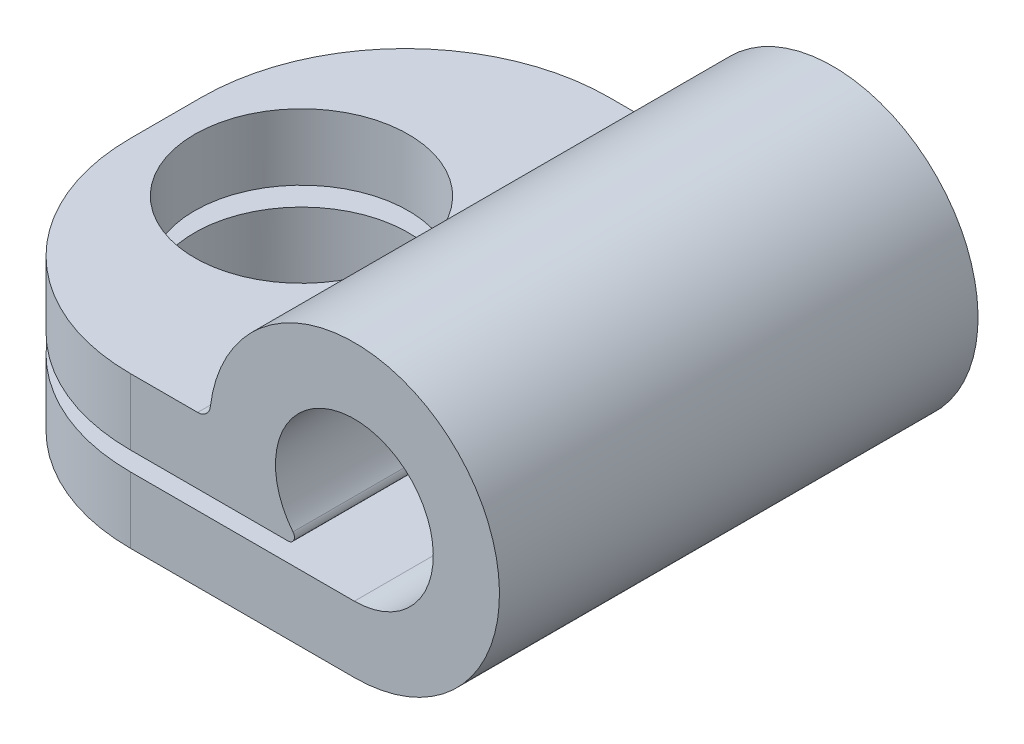
ISO-10303-21;
HEADER;
FILE_DESCRIPTION(('STEP AP214'),'2;1');
FILE_NAME('part.step','',(''),(''),'','','');
FILE_SCHEMA(('AUTOMOTIVE_DESIGN { 1 0 10303 214 1 1 1 1 }'));
ENDSEC;
DATA;
#1=APPLICATION_CONTEXT('core data for automotive mechanical design processes');
#2=APPLICATION_PROTOCOL_DEFINITION('international standard','automotive_design',2000,#1);
#3=PRODUCT_CONTEXT('',#1,'mechanical');
#4=PRODUCT('Part','Part','',(#3));
#5=PRODUCT_RELATED_PRODUCT_CATEGORY('part','',(#4));
#6=PRODUCT_DEFINITION_FORMATION('','',#4);
#7=PRODUCT_DEFINITION_CONTEXT('part definition',#1,'design');
#8=PRODUCT_DEFINITION('design','',#6,#7);
#9=PRODUCT_DEFINITION_SHAPE('','',#8);
#10=(LENGTH_UNIT() NAMED_UNIT(*) SI_UNIT(.MILLI.,.METRE.));
#11=(NAMED_UNIT(*) PLANE_ANGLE_UNIT() SI_UNIT($,.RADIAN.));
#12=(NAMED_UNIT(*) SI_UNIT($,.STERADIAN.) SOLID_ANGLE_UNIT());
#13=UNCERTAINTY_MEASURE_WITH_UNIT(LENGTH_MEASURE(1.E-05),#10,'distance_accuracy_value','');
#14=(GEOMETRIC_REPRESENTATION_CONTEXT(3) GLOBAL_UNCERTAINTY_ASSIGNED_CONTEXT((#13)) GLOBAL_UNIT_ASSIGNED_CONTEXT((#10,
#11,#12)) REPRESENTATION_CONTEXT('',''));
#15=CARTESIAN_POINT('',(0.,0.,0.));
#16=DIRECTION('',(0.,0.,1.));
#17=DIRECTION('',(1.,0.,0.));
#18=AXIS2_PLACEMENT_3D('',#15,#16,#17);
#19=CARTESIAN_POINT('',(-1.3027933545361,-1.05278415421993,9.4));
#20=DIRECTION('',(0.,0.,-1.));
#21=DIRECTION('',(-1.,0.,0.));
#22=AXIS2_PLACEMENT_3D('',#19,#20,#21);
#23=CYLINDRICAL_SURFACE('',#22,0.125);
#24=CARTESIAN_POINT('',(-1.3027933545361,-1.05278415421993,0.));
#25=DIRECTION('',(0.,0.,1.));
#26=DIRECTION('',(1.,0.,0.));
#27=AXIS2_PLACEMENT_3D('',#24,#25,#26);
#28=CIRCLE('',#27,0.125);
#29=CARTESIAN_POINT('',(-1.3027933545361,-1.17778415421993,0.));
#30=VERTEX_POINT('',#29);
#31=CARTESIAN_POINT('',(-1.20556996986923,-0.974218172561726,0.));
#32=VERTEX_POINT('',#31);
#33=EDGE_CURVE('E161',#30,#32,#28,.T.);
#34=ORIENTED_EDGE('',*,*,#33,.T.);
#35=DIRECTION('',(0.,0.,-1.));
#36=VECTOR('',#35,1.);
#37=CARTESIAN_POINT('',(-1.20556996986923,-0.974218172561726,9.4));
#38=LINE('',#37,#36);
#39=CARTESIAN_POINT('',(-1.20556996986923,-0.974218172561726,9.4));
#40=VERTEX_POINT('',#39);
#41=EDGE_CURVE('E140',#40,#32,#38,.T.);
#42=ORIENTED_EDGE('',*,*,#41,.F.);
#43=CARTESIAN_POINT('',(-1.3027933545361,-1.05278415421993,9.4));
#44=DIRECTION('',(0.,0.,1.));
#45=DIRECTION('',(1.,0.,0.));
#46=AXIS2_PLACEMENT_3D('',#43,#44,#45);
#47=CIRCLE('',#46,0.125);
#48=CARTESIAN_POINT('',(-1.3027933545361,-1.17778415421993,9.4));
#49=VERTEX_POINT('',#48);
#50=EDGE_CURVE('E148',#49,#40,#47,.T.);
#51=ORIENTED_EDGE('',*,*,#50,.F.);
#52=DIRECTION('',(0.,0.,-1.));
#53=VECTOR('',#52,1.);
#54=CARTESIAN_POINT('',(-1.3027933545361,-1.17778415421993,9.4));
#55=LINE('',#54,#53);
#56=EDGE_CURVE('E210',#49,#30,#55,.T.);
#57=ORIENTED_EDGE('',*,*,#56,.T.);
#58=EDGE_LOOP('',(#34,#42,#51,#57));
#59=FACE_BOUND('',#58,.T.);
#60=ADVANCED_FACE('F35',(#59),#23,.T.);
#61=CARTESIAN_POINT('',(0.,0.,9.4));
#62=DIRECTION('',(0.,0.,-1.));
#63=DIRECTION('',(-1.,0.,0.));
#64=AXIS2_PLACEMENT_3D('',#61,#62,#63);
#65=CYLINDRICAL_SURFACE('',#64,1.55);
#66=CARTESIAN_POINT('',(0.,0.,0.));
#67=DIRECTION('',(0.,0.,-1.));
#68=DIRECTION('',(1.,0.,0.));
#69=AXIS2_PLACEMENT_3D('',#66,#67,#68);
#70=CIRCLE('',#69,1.55);
#71=CARTESIAN_POINT('',(0.,-1.55,0.));
#72=VERTEX_POINT('',#71);
#73=EDGE_CURVE('E256',#32,#72,#70,.T.);
#74=ORIENTED_EDGE('',*,*,#73,.T.);
#75=DIRECTION('',(0.,0.,-1.));
#76=VECTOR('',#75,1.);
#77=CARTESIAN_POINT('',(0.,-1.55,9.4));
#78=LINE('',#77,#76);
#79=CARTESIAN_POINT('',(0.,-1.55,9.4));
#80=VERTEX_POINT('',#79);
#81=EDGE_CURVE('E143',#80,#72,#78,.T.);
#82=ORIENTED_EDGE('',*,*,#81,.F.);
#83=CARTESIAN_POINT('',(0.,0.,9.4));
#84=DIRECTION('',(0.,0.,-1.));
#85=DIRECTION('',(1.,0.,0.));
#86=AXIS2_PLACEMENT_3D('',#83,#84,#85);
#87=CIRCLE('',#86,1.55);
#88=EDGE_CURVE('E136',#40,#80,#87,.T.);
#89=ORIENTED_EDGE('',*,*,#88,.F.);
#90=ORIENTED_EDGE('',*,*,#41,.T.);
#91=EDGE_LOOP('',(#74,#82,#89,#90));
#92=FACE_BOUND('',#91,.T.);
#93=ADVANCED_FACE('F138',(#92),#65,.F.);
#94=CARTESIAN_POINT('',(0.,-1.55,9.4));
#95=DIRECTION('',(0.,-1.,0.));
#96=DIRECTION('',(1.,0.,0.));
#97=AXIS2_PLACEMENT_3D('',#94,#95,#96);
#98=PLANE('',#97);
#99=CARTESIAN_POINT('',(-5.73878648325151,-1.55,4.7));
#100=DIRECTION('',(0.,-1.,0.));
#101=DIRECTION('',(1.,0.,0.));
#102=AXIS2_PLACEMENT_3D('',#99,#100,#101);
#103=CIRCLE('',#102,2.1);
#104=CARTESIAN_POINT('',(-3.63878648325151,-1.55,4.7));
#105=VERTEX_POINT('',#104);
#106=EDGE_CURVE('E263',#105,#105,#103,.T.);
#107=ORIENTED_EDGE('',*,*,#106,.T.);
#108=EDGE_LOOP('',(#107));
#109=FACE_BOUND('',#108,.T.);
#110=DIRECTION('',(-1.,0.,0.));
#111=VECTOR('',#110,1.);
#112=CARTESIAN_POINT('',(0.,-1.55,0.));
#113=LINE('',#112,#111);
#114=CARTESIAN_POINT('',(-4.4,-1.55,0.));
#115=VERTEX_POINT('',#114);
#116=EDGE_CURVE('E252',#72,#115,#113,.T.);
#117=ORIENTED_EDGE('',*,*,#116,.T.);
#118=CARTESIAN_POINT('',(-4.4,-1.55,4.));
#119=DIRECTION('',(0.,-1.,0.));
#120=DIRECTION('',(1.,0.,0.));
#121=AXIS2_PLACEMENT_3D('',#118,#119,#120);
#122=CIRCLE('',#121,4.);
#123=CARTESIAN_POINT('',(-8.4,-1.55,4.));
#124=VERTEX_POINT('',#123);
#125=EDGE_CURVE('E187',#115,#124,#122,.F.);
#126=ORIENTED_EDGE('',*,*,#125,.T.);
#127=DIRECTION('',(0.,0.,-1.));
#128=VECTOR('',#127,1.);
#129=CARTESIAN_POINT('',(-8.4,-1.55,9.4));
#130=LINE('',#129,#128);
#131=CARTESIAN_POINT('',(-8.4,-1.55,5.4));
#132=VERTEX_POINT('',#131);
#133=EDGE_CURVE('E166',#132,#124,#130,.T.);
#134=ORIENTED_EDGE('',*,*,#133,.F.);
#135=CARTESIAN_POINT('',(-4.4,-1.55,5.4));
#136=DIRECTION('',(0.,-1.,0.));
#137=DIRECTION('',(1.,0.,0.));
#138=AXIS2_PLACEMENT_3D('',#135,#136,#137);
#139=CIRCLE('',#138,4.);
#140=CARTESIAN_POINT('',(-4.4,-1.55,9.4));
#141=VERTEX_POINT('',#140);
#142=EDGE_CURVE('E185',#132,#141,#139,.F.);
#143=ORIENTED_EDGE('',*,*,#142,.T.);
#144=DIRECTION('',(-1.,0.,0.));
#145=VECTOR('',#144,1.);
#146=CARTESIAN_POINT('',(0.,-1.55,9.4));
#147=LINE('',#146,#145);
#148=EDGE_CURVE('E147',#80,#141,#147,.T.);
#149=ORIENTED_EDGE('',*,*,#148,.F.);
#150=ORIENTED_EDGE('',*,*,#81,.T.);
#151=EDGE_LOOP('',(#117,#126,#134,#143,#149,#150));
#152=FACE_BOUND('',#151,.T.);
#153=ADVANCED_FACE('F310',(#109,#152),#98,.F.);
#154=CARTESIAN_POINT('',(-8.4,-2.85,9.4));
#155=DIRECTION('',(1.,0.,0.));
#156=DIRECTION('',(0.,0.,-1.));
#157=AXIS2_PLACEMENT_3D('',#154,#155,#156);
#158=PLANE('',#157);
#159=ORIENTED_EDGE('',*,*,#133,.T.);
#160=DIRECTION('',(0.,-1.,0.));
#161=VECTOR('',#160,1.);
#162=CARTESIAN_POINT('',(-8.4,-2.85,4.));
#163=LINE('',#162,#161);
#164=CARTESIAN_POINT('',(-8.4,-2.85,4.));
#165=VERTEX_POINT('',#164);
#166=EDGE_CURVE('E164',#124,#165,#163,.T.);
#167=ORIENTED_EDGE('',*,*,#166,.T.);
#168=DIRECTION('',(0.,0.,-1.));
#169=VECTOR('',#168,1.);
#170=CARTESIAN_POINT('',(-8.4,-2.85,9.4));
#171=LINE('',#170,#169);
#172=CARTESIAN_POINT('',(-8.4,-2.85,5.4));
#173=VERTEX_POINT('',#172);
#174=EDGE_CURVE('E225',#173,#165,#171,.T.);
#175=ORIENTED_EDGE('',*,*,#174,.F.);
#176=DIRECTION('',(0.,-1.,0.));
#177=VECTOR('',#176,1.);
#178=CARTESIAN_POINT('',(-8.4,-1.55,5.4));
#179=LINE('',#178,#177);
#180=EDGE_CURVE('E162',#173,#132,#179,.F.);
#181=ORIENTED_EDGE('',*,*,#180,.T.);
#182=EDGE_LOOP('',(#159,#167,#175,#181));
#183=FACE_BOUND('',#182,.T.);
#184=ADVANCED_FACE('F231',(#183),#158,.F.);
#185=CARTESIAN_POINT('',(0.,-2.85,9.4));
#186=DIRECTION('',(0.,1.,0.));
#187=DIRECTION('',(0.,0.,1.));
#188=AXIS2_PLACEMENT_3D('',#185,#186,#187);
#189=PLANE('',#188);
#190=CARTESIAN_POINT('',(-5.73878648325151,-2.85,4.7));
#191=DIRECTION('',(0.,1.,0.));
#192=DIRECTION('',(0.,0.,1.));
#193=AXIS2_PLACEMENT_3D('',#190,#191,#192);
#194=CIRCLE('',#193,2.1);
#195=CARTESIAN_POINT('',(-5.73878648325151,-2.85,6.8));
#196=VERTEX_POINT('',#195);
#197=EDGE_CURVE('E172',#196,#196,#194,.T.);
#198=ORIENTED_EDGE('',*,*,#197,.T.);
#199=EDGE_LOOP('',(#198));
#200=FACE_BOUND('',#199,.T.);
#201=ORIENTED_EDGE('',*,*,#174,.T.);
#202=CARTESIAN_POINT('',(-4.4,-2.85,4.));
#203=DIRECTION('',(0.,1.,0.));
#204=DIRECTION('',(0.,0.,1.));
#205=AXIS2_PLACEMENT_3D('',#202,#203,#204);
#206=CIRCLE('',#205,4.);
#207=CARTESIAN_POINT('',(-4.4,-2.85,0.));
#208=VERTEX_POINT('',#207);
#209=EDGE_CURVE('E179',#165,#208,#206,.F.);
#210=ORIENTED_EDGE('',*,*,#209,.T.);
#211=DIRECTION('',(1.,0.,0.));
#212=VECTOR('',#211,1.);
#213=CARTESIAN_POINT('',(0.,-2.85,0.));
#214=LINE('',#213,#212);
#215=CARTESIAN_POINT('',(0.,-2.85,0.));
#216=VERTEX_POINT('',#215);
#217=EDGE_CURVE('E244',#208,#216,#214,.T.);
#218=ORIENTED_EDGE('',*,*,#217,.T.);
#219=DIRECTION('',(0.,0.,-1.));
#220=VECTOR('',#219,1.);
#221=CARTESIAN_POINT('',(0.,-2.85,9.4));
#222=LINE('',#221,#220);
#223=CARTESIAN_POINT('',(0.,-2.85,9.4));
#224=VERTEX_POINT('',#223);
#225=EDGE_CURVE('E222',#224,#216,#222,.T.);
#226=ORIENTED_EDGE('',*,*,#225,.F.);
#227=DIRECTION('',(1.,0.,0.));
#228=VECTOR('',#227,1.);
#229=CARTESIAN_POINT('',(0.,-2.85,9.4));
#230=LINE('',#229,#228);
#231=CARTESIAN_POINT('',(-4.4,-2.85,9.4));
#232=VERTEX_POINT('',#231);
#233=EDGE_CURVE('E276',#232,#224,#230,.T.);
#234=ORIENTED_EDGE('',*,*,#233,.F.);
#235=CARTESIAN_POINT('',(-4.4,-2.85,5.4));
#236=DIRECTION('',(0.,1.,0.));
#237=DIRECTION('',(0.,0.,1.));
#238=AXIS2_PLACEMENT_3D('',#235,#236,#237);
#239=CIRCLE('',#238,4.);
#240=EDGE_CURVE('E177',#232,#173,#239,.F.);
#241=ORIENTED_EDGE('',*,*,#240,.T.);
#242=EDGE_LOOP('',(#201,#210,#218,#226,#234,#241));
#243=FACE_BOUND('',#242,.T.);
#244=ADVANCED_FACE('F242',(#200,#243),#189,.F.);
#245=CARTESIAN_POINT('',(0.,0.,9.4));
#246=DIRECTION('',(0.,0.,-1.));
#247=DIRECTION('',(-1.,0.,0.));
#248=AXIS2_PLACEMENT_3D('',#245,#246,#247);
#249=CYLINDRICAL_SURFACE('',#248,2.85);
#250=CARTESIAN_POINT('',(0.,0.,0.));
#251=DIRECTION('',(0.,0.,1.));
#252=DIRECTION('',(1.,0.,0.));
#253=AXIS2_PLACEMENT_3D('',#250,#251,#252);
#254=CIRCLE('',#253,2.85);
#255=CARTESIAN_POINT('',(-2.82938159823665,0.342198438862322,0.));
#256=VERTEX_POINT('',#255);
#257=EDGE_CURVE('E251',#216,#256,#254,.T.);
#258=ORIENTED_EDGE('',*,*,#257,.T.);
#259=DIRECTION('',(0.,0.,-1.));
#260=VECTOR('',#259,1.);
#261=CARTESIAN_POINT('',(-2.82938159823665,0.342198438862322,9.4));
#262=LINE('',#261,#260);
#263=CARTESIAN_POINT('',(-2.82938159823665,0.342198438862322,9.4));
#264=VERTEX_POINT('',#263);
#265=EDGE_CURVE('E219',#264,#256,#262,.T.);
#266=ORIENTED_EDGE('',*,*,#265,.F.);
#267=CARTESIAN_POINT('',(0.,0.,9.4));
#268=DIRECTION('',(0.,0.,1.));
#269=DIRECTION('',(1.,0.,0.));
#270=AXIS2_PLACEMENT_3D('',#267,#268,#269);
#271=CIRCLE('',#270,2.85);
#272=EDGE_CURVE('E274',#224,#264,#271,.T.);
#273=ORIENTED_EDGE('',*,*,#272,.F.);
#274=ORIENTED_EDGE('',*,*,#225,.T.);
#275=EDGE_LOOP('',(#258,#266,#273,#274));
#276=FACE_BOUND('',#275,.T.);
#277=ADVANCED_FACE('F326',(#276),#249,.T.);
#278=CARTESIAN_POINT('',(-3.07757296650303,0.372215845780069,9.4));
#279=DIRECTION('',(0.,0.,-1.));
#280=DIRECTION('',(-1.,0.,0.));
#281=AXIS2_PLACEMENT_3D('',#278,#279,#280);
#282=CYLINDRICAL_SURFACE('',#281,0.25);
#283=CARTESIAN_POINT('',(-3.07757296650303,0.372215845780069,0.));
#284=DIRECTION('',(0.,0.,-1.));
#285=DIRECTION('',(1.,0.,0.));
#286=AXIS2_PLACEMENT_3D('',#283,#284,#285);
#287=CIRCLE('',#286,0.25);
#288=CARTESIAN_POINT('',(-3.07757296650303,0.122215845780069,0.));
#289=VERTEX_POINT('',#288);
#290=EDGE_CURVE('E254',#256,#289,#287,.T.);
#291=ORIENTED_EDGE('',*,*,#290,.T.);
#292=DIRECTION('',(0.,0.,-1.));
#293=VECTOR('',#292,1.);
#294=CARTESIAN_POINT('',(-3.07757296650303,0.122215845780069,9.4));
#295=LINE('',#294,#293);
#296=CARTESIAN_POINT('',(-3.07757296650303,0.122215845780069,9.4));
#297=VERTEX_POINT('',#296);
#298=EDGE_CURVE('E212',#297,#289,#295,.T.);
#299=ORIENTED_EDGE('',*,*,#298,.F.);
#300=CARTESIAN_POINT('',(-3.07757296650303,0.372215845780069,9.4));
#301=DIRECTION('',(0.,0.,-1.));
#302=DIRECTION('',(1.,0.,0.));
#303=AXIS2_PLACEMENT_3D('',#300,#301,#302);
#304=CIRCLE('',#303,0.25);
#305=EDGE_CURVE('E272',#264,#297,#304,.T.);
#306=ORIENTED_EDGE('',*,*,#305,.F.);
#307=ORIENTED_EDGE('',*,*,#265,.T.);
#308=EDGE_LOOP('',(#291,#299,#306,#307));
#309=FACE_BOUND('',#308,.T.);
#310=ADVANCED_FACE('F289',(#309),#282,.F.);
#311=CARTESIAN_POINT('',(-3.07757296650303,0.122215845780069,9.4));
#312=DIRECTION('',(0.,-1.,0.));
#313=DIRECTION('',(1.,0.,0.));
#314=AXIS2_PLACEMENT_3D('',#311,#312,#313);
#315=PLANE('',#314);
#316=CARTESIAN_POINT('',(-5.73878648325151,0.122215845780069,4.7));
#317=DIRECTION('',(0.,1.,0.));
#318=DIRECTION('',(-1.,0.,0.));
#319=AXIS2_PLACEMENT_3D('',#316,#317,#318);
#320=CIRCLE('',#319,2.1);
#321=CARTESIAN_POINT('',(-7.83878648325151,0.122215845780069,4.7));
#322=VERTEX_POINT('',#321);
#323=EDGE_CURVE('E173',#322,#322,#320,.T.);
#324=ORIENTED_EDGE('',*,*,#323,.F.);
#325=EDGE_LOOP('',(#324));
#326=FACE_BOUND('',#325,.T.);
#327=DIRECTION('',(0.,0.,-1.));
#328=VECTOR('',#327,1.);
#329=CARTESIAN_POINT('',(-8.4,0.122215845780069,9.4));
#330=LINE('',#329,#328);
#331=CARTESIAN_POINT('',(-8.4,0.122215845780069,5.4));
#332=VERTEX_POINT('',#331);
#333=CARTESIAN_POINT('',(-8.4,0.122215845780069,4.));
#334=VERTEX_POINT('',#333);
#335=EDGE_CURVE('E205',#332,#334,#330,.T.);
#336=ORIENTED_EDGE('',*,*,#335,.F.);
#337=CARTESIAN_POINT('',(-4.4,0.122215845780069,5.4));
#338=DIRECTION('',(0.,-1.,0.));
#339=DIRECTION('',(1.,0.,0.));
#340=AXIS2_PLACEMENT_3D('',#337,#338,#339);
#341=CIRCLE('',#340,4.);
#342=CARTESIAN_POINT('',(-4.4,0.122215845780069,9.4));
#343=VERTEX_POINT('',#342);
#344=EDGE_CURVE('E11',#332,#343,#341,.F.);
#345=ORIENTED_EDGE('',*,*,#344,.T.);
#346=DIRECTION('',(-1.,0.,0.));
#347=VECTOR('',#346,1.);
#348=CARTESIAN_POINT('',(-3.07757296650303,0.122215845780069,9.4));
#349=LINE('',#348,#347);
#350=EDGE_CURVE('E269',#297,#343,#349,.T.);
#351=ORIENTED_EDGE('',*,*,#350,.F.);
#352=ORIENTED_EDGE('',*,*,#298,.T.);
#353=DIRECTION('',(-1.,0.,0.));
#354=VECTOR('',#353,1.);
#355=CARTESIAN_POINT('',(-3.07757296650303,0.122215845780069,0.));
#356=LINE('',#355,#354);
#357=CARTESIAN_POINT('',(-4.4,0.122215845780069,0.));
#358=VERTEX_POINT('',#357);
#359=EDGE_CURVE('E261',#289,#358,#356,.T.);
#360=ORIENTED_EDGE('',*,*,#359,.T.);
#361=CARTESIAN_POINT('',(-4.4,0.122215845780069,4.));
#362=DIRECTION('',(0.,-1.,0.));
#363=DIRECTION('',(1.,0.,0.));
#364=AXIS2_PLACEMENT_3D('',#361,#362,#363);
#365=CIRCLE('',#364,4.);
#366=EDGE_CURVE('E43',#358,#334,#365,.F.);
#367=ORIENTED_EDGE('',*,*,#366,.T.);
#368=EDGE_LOOP('',(#336,#345,#351,#352,#360,#367));
#369=FACE_BOUND('',#368,.T.);
#370=ADVANCED_FACE('F287',(#326,#369),#315,.F.);
#371=CARTESIAN_POINT('',(-8.4,0.122215845780069,9.4));
#372=DIRECTION('',(1.,0.,0.));
#373=DIRECTION('',(0.,0.,-1.));
#374=AXIS2_PLACEMENT_3D('',#371,#372,#373);
#375=PLANE('',#374);
#376=DIRECTION('',(0.,0.,-1.));
#377=VECTOR('',#376,1.);
#378=CARTESIAN_POINT('',(-8.4,-1.17778415421993,9.4));
#379=LINE('',#378,#377);
#380=CARTESIAN_POINT('',(-8.4,-1.17778415421993,5.4));
#381=VERTEX_POINT('',#380);
#382=CARTESIAN_POINT('',(-8.4,-1.17778415421993,4.));
#383=VERTEX_POINT('',#382);
#384=EDGE_CURVE('E204',#381,#383,#379,.T.);
#385=ORIENTED_EDGE('',*,*,#384,.F.);
#386=DIRECTION('',(0.,-1.,0.));
#387=VECTOR('',#386,1.);
#388=CARTESIAN_POINT('',(-8.4,0.122215845780069,5.4));
#389=LINE('',#388,#387);
#390=EDGE_CURVE('E56',#381,#332,#389,.F.);
#391=ORIENTED_EDGE('',*,*,#390,.T.);
#392=ORIENTED_EDGE('',*,*,#335,.T.);
#393=DIRECTION('',(0.,-1.,0.));
#394=VECTOR('',#393,1.);
#395=CARTESIAN_POINT('',(-8.4,0.122215845780069,4.));
#396=LINE('',#395,#394);
#397=EDGE_CURVE('E198',#334,#383,#396,.T.);
#398=ORIENTED_EDGE('',*,*,#397,.T.);
#399=EDGE_LOOP('',(#385,#391,#392,#398));
#400=FACE_BOUND('',#399,.T.);
#401=ADVANCED_FACE('F203',(#400),#375,.F.);
#402=CARTESIAN_POINT('',(-1.3027933545361,-1.17778415421993,9.4));
#403=DIRECTION('',(0.,1.,0.));
#404=DIRECTION('',(0.,0.,1.));
#405=AXIS2_PLACEMENT_3D('',#402,#403,#404);
#406=PLANE('',#405);
#407=CARTESIAN_POINT('',(-5.73878648325151,-1.17778415421993,4.7));
#408=DIRECTION('',(0.,1.,0.));
#409=DIRECTION('',(0.,0.,1.));
#410=AXIS2_PLACEMENT_3D('',#407,#408,#409);
#411=CIRCLE('',#410,2.1);
#412=CARTESIAN_POINT('',(-5.73878648325151,-1.17778415421993,6.8));
#413=VERTEX_POINT('',#412);
#414=EDGE_CURVE('E170',#413,#413,#411,.T.);
#415=ORIENTED_EDGE('',*,*,#414,.T.);
#416=EDGE_LOOP('',(#415));
#417=FACE_BOUND('',#416,.T.);
#418=DIRECTION('',(1.,0.,0.));
#419=VECTOR('',#418,1.);
#420=CARTESIAN_POINT('',(-1.3027933545361,-1.17778415421993,9.4));
#421=LINE('',#420,#419);
#422=CARTESIAN_POINT('',(-4.4,-1.17778415421993,9.4));
#423=VERTEX_POINT('',#422);
#424=EDGE_CURVE('E154',#423,#49,#421,.T.);
#425=ORIENTED_EDGE('',*,*,#424,.F.);
#426=CARTESIAN_POINT('',(-4.4,-1.17778415421993,5.4));
#427=DIRECTION('',(0.,1.,0.));
#428=DIRECTION('',(0.,0.,1.));
#429=AXIS2_PLACEMENT_3D('',#426,#427,#428);
#430=CIRCLE('',#429,4.);
#431=EDGE_CURVE('E196',#423,#381,#430,.F.);
#432=ORIENTED_EDGE('',*,*,#431,.T.);
#433=ORIENTED_EDGE('',*,*,#384,.T.);
#434=CARTESIAN_POINT('',(-4.4,-1.17778415421993,4.));
#435=DIRECTION('',(0.,1.,0.));
#436=DIRECTION('',(0.,0.,1.));
#437=AXIS2_PLACEMENT_3D('',#434,#435,#436);
#438=CIRCLE('',#437,4.);
#439=CARTESIAN_POINT('',(-4.4,-1.17778415421993,0.));
#440=VERTEX_POINT('',#439);
#441=EDGE_CURVE('E194',#383,#440,#438,.F.);
#442=ORIENTED_EDGE('',*,*,#441,.T.);
#443=DIRECTION('',(1.,0.,0.));
#444=VECTOR('',#443,1.);
#445=CARTESIAN_POINT('',(-1.3027933545361,-1.17778415421993,0.));
#446=LINE('',#445,#444);
#447=EDGE_CURVE('E158',#440,#30,#446,.T.);
#448=ORIENTED_EDGE('',*,*,#447,.T.);
#449=ORIENTED_EDGE('',*,*,#56,.F.);
#450=EDGE_LOOP('',(#425,#432,#433,#442,#448,#449));
#451=FACE_BOUND('',#450,.T.);
#452=ADVANCED_FACE('F208',(#417,#451),#406,.F.);
#453=CARTESIAN_POINT('',(-1.3027933545361,-1.05278415421993,9.4));
#454=DIRECTION('',(0.,0.,1.));
#455=DIRECTION('',(1.,0.,0.));
#456=AXIS2_PLACEMENT_3D('',#453,#454,#455);
#457=PLANE('',#456);
#458=ORIENTED_EDGE('',*,*,#148,.T.);
#459=DIRECTION('',(0.,-1.,0.));
#460=VECTOR('',#459,1.);
#461=CARTESIAN_POINT('',(-4.4,-2.85,9.4));
#462=LINE('',#461,#460);
#463=EDGE_CURVE('E191',#141,#232,#462,.T.);
#464=ORIENTED_EDGE('',*,*,#463,.T.);
#465=ORIENTED_EDGE('',*,*,#233,.T.);
#466=ORIENTED_EDGE('',*,*,#272,.T.);
#467=ORIENTED_EDGE('',*,*,#305,.T.);
#468=ORIENTED_EDGE('',*,*,#350,.T.);
#469=DIRECTION('',(0.,-1.,0.));
#470=VECTOR('',#469,1.);
#471=CARTESIAN_POINT('',(-4.4,-1.17778415421993,9.4));
#472=LINE('',#471,#470);
#473=EDGE_CURVE('E189',#343,#423,#472,.T.);
#474=ORIENTED_EDGE('',*,*,#473,.T.);
#475=ORIENTED_EDGE('',*,*,#424,.T.);
#476=ORIENTED_EDGE('',*,*,#50,.T.);
#477=ORIENTED_EDGE('',*,*,#88,.T.);
#478=EDGE_LOOP('',(#458,#464,#465,#466,#467,#468,#474,#475,#476,#477));
#479=FACE_BOUND('',#478,.T.);
#480=ADVANCED_FACE('F151',(#479),#457,.T.);
#481=CARTESIAN_POINT('',(-1.3027933545361,-1.05278415421993,0.));
#482=DIRECTION('',(0.,0.,1.));
#483=DIRECTION('',(1.,0.,0.));
#484=AXIS2_PLACEMENT_3D('',#481,#482,#483);
#485=PLANE('',#484);
#486=ORIENTED_EDGE('',*,*,#217,.F.);
#487=DIRECTION('',(0.,-1.,0.));
#488=VECTOR('',#487,1.);
#489=CARTESIAN_POINT('',(-4.4,-1.05278415421993,0.));
#490=LINE('',#489,#488);
#491=EDGE_CURVE('E183',#208,#115,#490,.F.);
#492=ORIENTED_EDGE('',*,*,#491,.T.);
#493=ORIENTED_EDGE('',*,*,#116,.F.);
#494=ORIENTED_EDGE('',*,*,#73,.F.);
#495=ORIENTED_EDGE('',*,*,#33,.F.);
#496=ORIENTED_EDGE('',*,*,#447,.F.);
#497=DIRECTION('',(0.,-1.,0.));
#498=VECTOR('',#497,1.);
#499=CARTESIAN_POINT('',(-4.4,-1.05278415421993,0.));
#500=LINE('',#499,#498);
#501=EDGE_CURVE('E181',#440,#358,#500,.F.);
#502=ORIENTED_EDGE('',*,*,#501,.T.);
#503=ORIENTED_EDGE('',*,*,#359,.F.);
#504=ORIENTED_EDGE('',*,*,#290,.F.);
#505=ORIENTED_EDGE('',*,*,#257,.F.);
#506=EDGE_LOOP('',(#486,#492,#493,#494,#495,#496,#502,#503,#504,#505));
#507=FACE_BOUND('',#506,.T.);
#508=ADVANCED_FACE('F247',(#507),#485,.F.);
#509=CARTESIAN_POINT('',(-5.73878648325151,-9.27778415421993,4.7));
#510=DIRECTION('',(0.,1.,0.));
#511=DIRECTION('',(-1.,0.,0.));
#512=AXIS2_PLACEMENT_3D('',#509,#510,#511);
#513=CYLINDRICAL_SURFACE('',#512,2.1);
#514=ORIENTED_EDGE('',*,*,#323,.T.);
#515=EDGE_LOOP('',(#514));
#516=FACE_BOUND('',#515,.T.);
#517=ORIENTED_EDGE('',*,*,#414,.F.);
#518=EDGE_LOOP('',(#517));
#519=FACE_BOUND('',#518,.T.);
#520=ADVANCED_FACE('F284',(#516,#519),#513,.F.);
#521=ORIENTED_EDGE('',*,*,#197,.F.);
#522=EDGE_LOOP('',(#521));
#523=FACE_BOUND('',#522,.T.);
#524=ORIENTED_EDGE('',*,*,#106,.F.);
#525=EDGE_LOOP('',(#524));
#526=FACE_BOUND('',#525,.T.);
#527=ADVANCED_FACE('F316',(#523,#526),#513,.F.);
#528=CARTESIAN_POINT('',(-4.4,-2.85,4.));
#529=DIRECTION('',(0.,-1.,0.));
#530=DIRECTION('',(0.,0.,-1.));
#531=AXIS2_PLACEMENT_3D('',#528,#529,#530);
#532=CYLINDRICAL_SURFACE('',#531,4.);
#533=ORIENTED_EDGE('',*,*,#125,.F.);
#534=ORIENTED_EDGE('',*,*,#491,.F.);
#535=ORIENTED_EDGE('',*,*,#209,.F.);
#536=ORIENTED_EDGE('',*,*,#166,.F.);
#537=EDGE_LOOP('',(#533,#534,#535,#536));
#538=FACE_BOUND('',#537,.T.);
#539=ADVANCED_FACE('F238',(#538),#532,.T.);
#540=CARTESIAN_POINT('',(-4.4,-1.05278415421993,5.4));
#541=DIRECTION('',(0.,1.,0.));
#542=DIRECTION('',(0.,0.,1.));
#543=AXIS2_PLACEMENT_3D('',#540,#541,#542);
#544=CYLINDRICAL_SURFACE('',#543,4.);
#545=ORIENTED_EDGE('',*,*,#142,.F.);
#546=ORIENTED_EDGE('',*,*,#180,.F.);
#547=ORIENTED_EDGE('',*,*,#240,.F.);
#548=ORIENTED_EDGE('',*,*,#463,.F.);
#549=EDGE_LOOP('',(#545,#546,#547,#548));
#550=FACE_BOUND('',#549,.T.);
#551=ADVANCED_FACE('F304',(#550),#544,.T.);
#552=CARTESIAN_POINT('',(-4.4,-1.05278415421993,5.4));
#553=DIRECTION('',(0.,1.,0.));
#554=DIRECTION('',(0.,0.,1.));
#555=AXIS2_PLACEMENT_3D('',#552,#553,#554);
#556=CYLINDRICAL_SURFACE('',#555,4.);
#557=ORIENTED_EDGE('',*,*,#344,.F.);
#558=ORIENTED_EDGE('',*,*,#390,.F.);
#559=ORIENTED_EDGE('',*,*,#431,.F.);
#560=ORIENTED_EDGE('',*,*,#473,.F.);
#561=EDGE_LOOP('',(#557,#558,#559,#560));
#562=FACE_BOUND('',#561,.T.);
#563=ADVANCED_FACE('F295',(#562),#556,.T.);
#564=CARTESIAN_POINT('',(-4.4,0.122215845780069,4.));
#565=DIRECTION('',(0.,-1.,0.));
#566=DIRECTION('',(0.,0.,-1.));
#567=AXIS2_PLACEMENT_3D('',#564,#565,#566);
#568=CYLINDRICAL_SURFACE('',#567,4.);
#569=ORIENTED_EDGE('',*,*,#366,.F.);
#570=ORIENTED_EDGE('',*,*,#501,.F.);
#571=ORIENTED_EDGE('',*,*,#441,.F.);
#572=ORIENTED_EDGE('',*,*,#397,.F.);
#573=EDGE_LOOP('',(#569,#570,#571,#572));
#574=FACE_BOUND('',#573,.T.);
#575=ADVANCED_FACE('F37',(#574),#568,.T.);
#576=CLOSED_SHELL('',(#60,#93,#153,#184,#244,#277,#310,#370,#401,#452,#480,#508,#520,#527,#539,
#551,#563,#575));
#577=MANIFOLD_SOLID_BREP('B2',#576);
#578=ADVANCED_BREP_SHAPE_REPRESENTATION('',(#18,#577),#14);
#579=SHAPE_DEFINITION_REPRESENTATION(#9,#578);
ENDSEC;
END-ISO-10303-21;
